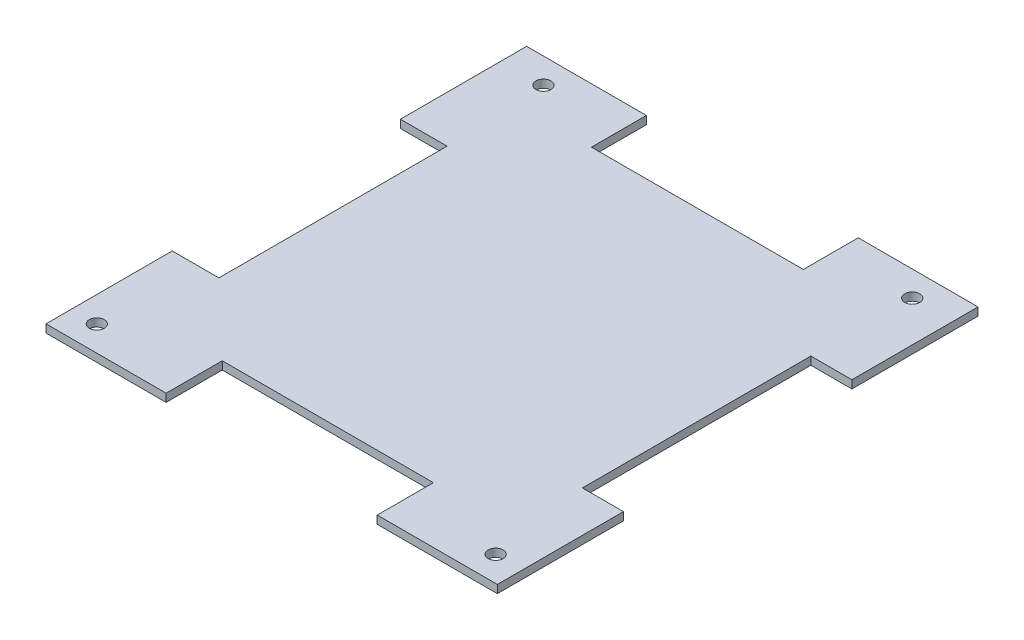
ISO-10303-21;
HEADER;
FILE_DESCRIPTION(('STEP AP214'),'2;1');
FILE_NAME('part.step','',(''),(''),'','','');
FILE_SCHEMA(('AUTOMOTIVE_DESIGN { 1 0 10303 214 1 1 1 1 }'));
ENDSEC;
DATA;
#1=APPLICATION_CONTEXT('core data for automotive mechanical design processes');
#2=APPLICATION_PROTOCOL_DEFINITION('international standard','automotive_design',2000,#1);
#3=PRODUCT_CONTEXT('',#1,'mechanical');
#4=PRODUCT('Part','Part','',(#3));
#5=PRODUCT_RELATED_PRODUCT_CATEGORY('part','',(#4));
#6=PRODUCT_DEFINITION_FORMATION('','',#4);
#7=PRODUCT_DEFINITION_CONTEXT('part definition',#1,'design');
#8=PRODUCT_DEFINITION('design','',#6,#7);
#9=PRODUCT_DEFINITION_SHAPE('','',#8);
#10=(LENGTH_UNIT() NAMED_UNIT(*) SI_UNIT(.MILLI.,.METRE.));
#11=(NAMED_UNIT(*) PLANE_ANGLE_UNIT() SI_UNIT($,.RADIAN.));
#12=(NAMED_UNIT(*) SI_UNIT($,.STERADIAN.) SOLID_ANGLE_UNIT());
#13=UNCERTAINTY_MEASURE_WITH_UNIT(LENGTH_MEASURE(1.E-05),#10,'distance_accuracy_value','');
#14=(GEOMETRIC_REPRESENTATION_CONTEXT(3) GLOBAL_UNCERTAINTY_ASSIGNED_CONTEXT((#13)) GLOBAL_UNIT_ASSIGNED_CONTEXT((#10,
#11,#12)) REPRESENTATION_CONTEXT('',''));
#15=CARTESIAN_POINT('',(0.,0.,0.));
#16=DIRECTION('',(0.,0.,1.));
#17=DIRECTION('',(1.,0.,0.));
#18=AXIS2_PLACEMENT_3D('',#15,#16,#17);
#19=CARTESIAN_POINT('',(0.,0.,2.54));
#20=DIRECTION('',(0.,0.,-1.));
#21=DIRECTION('',(-1.,0.,0.));
#22=AXIS2_PLACEMENT_3D('',#19,#20,#21);
#23=PLANE('',#22);
#24=DIRECTION('',(1.,0.,0.));
#25=VECTOR('',#24,1.);
#26=CARTESIAN_POINT('',(87.45,0.,2.54));
#27=LINE('',#26,#25);
#28=CARTESIAN_POINT('',(-2.59,0.,2.54));
#29=VERTEX_POINT('',#28);
#30=CARTESIAN_POINT('',(21.3706488480498,0.,2.54));
#31=VERTEX_POINT('',#30);
#32=EDGE_CURVE('E271',#29,#31,#27,.T.);
#33=ORIENTED_EDGE('',*,*,#32,.T.);
#34=DIRECTION('',(0.,1.,0.));
#35=VECTOR('',#34,1.);
#36=CARTESIAN_POINT('',(21.3706488480498,0.,2.54));
#37=LINE('',#36,#35);
#38=CARTESIAN_POINT('',(21.3706488480498,1.6,2.54));
#39=VERTEX_POINT('',#38);
#40=EDGE_CURVE('E11',#31,#39,#37,.T.);
#41=ORIENTED_EDGE('',*,*,#40,.T.);
#42=DIRECTION('',(-1.,0.,0.));
#43=VECTOR('',#42,1.);
#44=CARTESIAN_POINT('',(87.45,1.6,2.54));
#45=LINE('',#44,#43);
#46=CARTESIAN_POINT('',(-2.59,1.6,2.54));
#47=VERTEX_POINT('',#46);
#48=EDGE_CURVE('E264',#39,#47,#45,.T.);
#49=ORIENTED_EDGE('',*,*,#48,.T.);
#50=DIRECTION('',(0.,-1.,0.));
#51=VECTOR('',#50,1.);
#52=CARTESIAN_POINT('',(-2.59,1.6,2.54));
#53=LINE('',#52,#51);
#54=EDGE_CURVE('E268',#47,#29,#53,.T.);
#55=ORIENTED_EDGE('',*,*,#54,.T.);
#56=EDGE_LOOP('',(#33,#41,#49,#55));
#57=FACE_BOUND('',#56,.T.);
#58=ADVANCED_FACE('F34',(#57),#23,.F.);
#59=CARTESIAN_POINT('',(-2.59,0.,0.));
#60=DIRECTION('',(1.,0.,0.));
#61=DIRECTION('',(0.,0.,-1.));
#62=AXIS2_PLACEMENT_3D('',#59,#60,#61);
#63=PLANE('',#62);
#64=DIRECTION('',(0.,0.,1.));
#65=VECTOR('',#64,1.);
#66=CARTESIAN_POINT('',(-2.59,0.,-90.8));
#67=LINE('',#66,#65);
#68=CARTESIAN_POINT('',(-2.59,0.,-93.34));
#69=VERTEX_POINT('',#68);
#70=CARTESIAN_POINT('',(-2.59,0.,-68.1600542012034));
#71=VERTEX_POINT('',#70);
#72=EDGE_CURVE('E289',#69,#71,#67,.T.);
#73=ORIENTED_EDGE('',*,*,#72,.T.);
#74=DIRECTION('',(0.,1.,0.));
#75=VECTOR('',#74,1.);
#76=CARTESIAN_POINT('',(-2.59,0.,-68.1600542012034));
#77=LINE('',#76,#75);
#78=CARTESIAN_POINT('',(-2.59,1.6,-68.1600542012034));
#79=VERTEX_POINT('',#78);
#80=EDGE_CURVE('E340',#71,#79,#77,.T.);
#81=ORIENTED_EDGE('',*,*,#80,.T.);
#82=DIRECTION('',(0.,0.,-1.));
#83=VECTOR('',#82,1.);
#84=CARTESIAN_POINT('',(-2.59,1.6,-90.8));
#85=LINE('',#84,#83);
#86=CARTESIAN_POINT('',(-2.59,1.6,-93.34));
#87=VERTEX_POINT('',#86);
#88=EDGE_CURVE('E292',#79,#87,#85,.T.);
#89=ORIENTED_EDGE('',*,*,#88,.T.);
#90=DIRECTION('',(0.,1.,0.));
#91=VECTOR('',#90,1.);
#92=CARTESIAN_POINT('',(-2.59,0.,-93.34));
#93=LINE('',#92,#91);
#94=EDGE_CURVE('E274',#69,#87,#93,.T.);
#95=ORIENTED_EDGE('',*,*,#94,.F.);
#96=EDGE_LOOP('',(#73,#81,#89,#95));
#97=FACE_BOUND('',#96,.T.);
#98=ADVANCED_FACE('F373',(#97),#63,.F.);
#99=CARTESIAN_POINT('',(0.,0.,-93.34));
#100=DIRECTION('',(0.,0.,-1.));
#101=DIRECTION('',(-1.,0.,0.));
#102=AXIS2_PLACEMENT_3D('',#99,#100,#101);
#103=PLANE('',#102);
#104=DIRECTION('',(0.,1.,0.));
#105=VECTOR('',#104,1.);
#106=CARTESIAN_POINT('',(21.2967633827462,0.,-93.34));
#107=LINE('',#106,#105);
#108=CARTESIAN_POINT('',(21.2967633827462,0.,-93.34));
#109=VERTEX_POINT('',#108);
#110=CARTESIAN_POINT('',(21.2967633827462,1.6,-93.34));
#111=VERTEX_POINT('',#110);
#112=EDGE_CURVE('E336',#109,#111,#107,.T.);
#113=ORIENTED_EDGE('',*,*,#112,.F.);
#114=DIRECTION('',(-1.,0.,0.));
#115=VECTOR('',#114,1.);
#116=CARTESIAN_POINT('',(-2.59,0.,-93.34));
#117=LINE('',#116,#115);
#118=EDGE_CURVE('E284',#109,#69,#117,.T.);
#119=ORIENTED_EDGE('',*,*,#118,.T.);
#120=ORIENTED_EDGE('',*,*,#94,.T.);
#121=DIRECTION('',(1.,0.,0.));
#122=VECTOR('',#121,1.);
#123=CARTESIAN_POINT('',(-2.59,1.6,-93.34));
#124=LINE('',#123,#122);
#125=EDGE_CURVE('E278',#87,#111,#124,.T.);
#126=ORIENTED_EDGE('',*,*,#125,.T.);
#127=EDGE_LOOP('',(#113,#119,#120,#126));
#128=FACE_BOUND('',#127,.T.);
#129=ADVANCED_FACE('F377',(#128),#103,.T.);
#130=CARTESIAN_POINT('',(87.45,0.,0.));
#131=DIRECTION('',(-1.,0.,0.));
#132=DIRECTION('',(0.,0.,1.));
#133=AXIS2_PLACEMENT_3D('',#130,#131,#132);
#134=PLANE('',#133);
#135=DIRECTION('',(0.,0.,1.));
#136=VECTOR('',#135,1.);
#137=CARTESIAN_POINT('',(87.45,1.6,-90.8));
#138=LINE('',#137,#136);
#139=CARTESIAN_POINT('',(87.45,1.6,-93.34));
#140=VERTEX_POINT('',#139);
#141=CARTESIAN_POINT('',(87.45,1.6,-68.1857586213216));
#142=VERTEX_POINT('',#141);
#143=EDGE_CURVE('E297',#140,#142,#138,.T.);
#144=ORIENTED_EDGE('',*,*,#143,.T.);
#145=DIRECTION('',(0.,-1.,0.));
#146=VECTOR('',#145,1.);
#147=CARTESIAN_POINT('',(87.45,0.,-68.1857586213216));
#148=LINE('',#147,#146);
#149=CARTESIAN_POINT('',(87.45,0.,-68.1857586213216));
#150=VERTEX_POINT('',#149);
#151=EDGE_CURVE('E331',#142,#150,#148,.T.);
#152=ORIENTED_EDGE('',*,*,#151,.T.);
#153=DIRECTION('',(0.,0.,-1.));
#154=VECTOR('',#153,1.);
#155=CARTESIAN_POINT('',(87.45,0.,-90.8));
#156=LINE('',#155,#154);
#157=CARTESIAN_POINT('',(87.45,0.,-93.34));
#158=VERTEX_POINT('',#157);
#159=EDGE_CURVE('E300',#150,#158,#156,.T.);
#160=ORIENTED_EDGE('',*,*,#159,.T.);
#161=DIRECTION('',(0.,-1.,0.));
#162=VECTOR('',#161,1.);
#163=CARTESIAN_POINT('',(87.45,0.,-93.34));
#164=LINE('',#163,#162);
#165=EDGE_CURVE('E281',#140,#158,#164,.T.);
#166=ORIENTED_EDGE('',*,*,#165,.F.);
#167=EDGE_LOOP('',(#144,#152,#160,#166));
#168=FACE_BOUND('',#167,.T.);
#169=ADVANCED_FACE('F398',(#168),#134,.F.);
#170=CARTESIAN_POINT('',(0.,1.6,0.));
#171=DIRECTION('',(0.,-1.,0.));
#172=DIRECTION('',(0.,0.,-1.));
#173=AXIS2_PLACEMENT_3D('',#170,#171,#172);
#174=PLANE('',#173);
#175=CARTESIAN_POINT('',(79.37,1.6,-88.3));
#176=DIRECTION('',(0.,1.,0.));
#177=DIRECTION('',(0.,0.,1.));
#178=AXIS2_PLACEMENT_3D('',#175,#176,#177);
#179=CIRCLE('',#178,1.5);
#180=CARTESIAN_POINT('',(79.37,1.6,-86.8));
#181=VERTEX_POINT('',#180);
#182=EDGE_CURVE('E304',#181,#181,#179,.T.);
#183=ORIENTED_EDGE('',*,*,#182,.F.);
#184=EDGE_LOOP('',(#183));
#185=FACE_BOUND('',#184,.T.);
#186=CARTESIAN_POINT('',(5.8,1.6,-88.3));
#187=DIRECTION('',(0.,1.,0.));
#188=DIRECTION('',(0.,0.,1.));
#189=AXIS2_PLACEMENT_3D('',#186,#187,#188);
#190=CIRCLE('',#189,1.5);
#191=CARTESIAN_POINT('',(5.8,1.6,-86.8));
#192=VERTEX_POINT('',#191);
#193=EDGE_CURVE('E308',#192,#192,#190,.T.);
#194=ORIENTED_EDGE('',*,*,#193,.F.);
#195=EDGE_LOOP('',(#194));
#196=FACE_BOUND('',#195,.T.);
#197=CARTESIAN_POINT('',(82.07,1.6,-2.5));
#198=DIRECTION('',(0.,1.,0.));
#199=DIRECTION('',(0.,0.,1.));
#200=AXIS2_PLACEMENT_3D('',#197,#198,#199);
#201=CIRCLE('',#200,1.5);
#202=CARTESIAN_POINT('',(82.07,1.6,-1.));
#203=VERTEX_POINT('',#202);
#204=EDGE_CURVE('E314',#203,#203,#201,.T.);
#205=ORIENTED_EDGE('',*,*,#204,.F.);
#206=EDGE_LOOP('',(#205));
#207=FACE_BOUND('',#206,.T.);
#208=CARTESIAN_POINT('',(2.5,1.6,-2.5));
#209=DIRECTION('',(0.,1.,0.));
#210=DIRECTION('',(0.,0.,1.));
#211=AXIS2_PLACEMENT_3D('',#208,#209,#210);
#212=CIRCLE('',#211,1.5);
#213=CARTESIAN_POINT('',(2.5,1.6,-1.));
#214=VERTEX_POINT('',#213);
#215=EDGE_CURVE('E320',#214,#214,#212,.T.);
#216=ORIENTED_EDGE('',*,*,#215,.F.);
#217=EDGE_LOOP('',(#216));
#218=FACE_BOUND('',#217,.T.);
#219=ORIENTED_EDGE('',*,*,#48,.F.);
#220=DIRECTION('',(0.,0.,1.));
#221=VECTOR('',#220,1.);
#222=CARTESIAN_POINT('',(21.3706488480498,1.6,-8.66006941402019));
#223=LINE('',#222,#221);
#224=CARTESIAN_POINT('',(21.3706488480498,1.6,-8.66006941402019));
#225=VERTEX_POINT('',#224);
#226=EDGE_CURVE('E195',#225,#39,#223,.T.);
#227=ORIENTED_EDGE('',*,*,#226,.F.);
#228=DIRECTION('',(-1.,0.,0.));
#229=VECTOR('',#228,1.);
#230=CARTESIAN_POINT('',(63.4893511519502,1.6,-8.6600694140202));
#231=LINE('',#230,#229);
#232=CARTESIAN_POINT('',(63.4893511519502,1.6,-8.6600694140202));
#233=VERTEX_POINT('',#232);
#234=EDGE_CURVE('E192',#233,#225,#231,.T.);
#235=ORIENTED_EDGE('',*,*,#234,.F.);
#236=DIRECTION('',(0.,0.,-1.));
#237=VECTOR('',#236,1.);
#238=CARTESIAN_POINT('',(63.4893511519502,1.6,-8.6600694140202));
#239=LINE('',#238,#237);
#240=CARTESIAN_POINT('',(63.4893511519502,1.6,2.54));
#241=VERTEX_POINT('',#240);
#242=EDGE_CURVE('E173',#241,#233,#239,.T.);
#243=ORIENTED_EDGE('',*,*,#242,.F.);
#244=CARTESIAN_POINT('',(87.45,1.6,2.54));
#245=VERTEX_POINT('',#244);
#246=EDGE_CURVE('E265',#245,#241,#45,.T.);
#247=ORIENTED_EDGE('',*,*,#246,.F.);
#248=CARTESIAN_POINT('',(87.45,1.6,-22.6142413786784));
#249=VERTEX_POINT('',#248);
#250=EDGE_CURVE('E296',#249,#245,#138,.T.);
#251=ORIENTED_EDGE('',*,*,#250,.F.);
#252=DIRECTION('',(1.,0.,0.));
#253=VECTOR('',#252,1.);
#254=CARTESIAN_POINT('',(95.6363214880288,1.6,-22.6142413786784));
#255=LINE('',#254,#253);
#256=CARTESIAN_POINT('',(79.2636785119712,1.6,-22.6142413786784));
#257=VERTEX_POINT('',#256);
#258=EDGE_CURVE('E254',#257,#249,#255,.T.);
#259=ORIENTED_EDGE('',*,*,#258,.F.);
#260=DIRECTION('',(0.,0.,1.));
#261=VECTOR('',#260,1.);
#262=CARTESIAN_POINT('',(79.2636785119711,1.6,-68.1857586213216));
#263=LINE('',#262,#261);
#264=CARTESIAN_POINT('',(79.2636785119711,1.6,-68.1857586213216));
#265=VERTEX_POINT('',#264);
#266=EDGE_CURVE('E238',#265,#257,#263,.T.);
#267=ORIENTED_EDGE('',*,*,#266,.F.);
#268=DIRECTION('',(-1.,0.,0.));
#269=VECTOR('',#268,1.);
#270=CARTESIAN_POINT('',(95.6363214880288,1.6,-68.1857586213216));
#271=LINE('',#270,#269);
#272=EDGE_CURVE('E245',#142,#265,#271,.T.);
#273=ORIENTED_EDGE('',*,*,#272,.F.);
#274=ORIENTED_EDGE('',*,*,#143,.F.);
#275=CARTESIAN_POINT('',(63.5632366172538,1.6,-93.34));
#276=VERTEX_POINT('',#275);
#277=EDGE_CURVE('E277',#276,#140,#124,.T.);
#278=ORIENTED_EDGE('',*,*,#277,.F.);
#279=DIRECTION('',(0.,0.,-1.));
#280=VECTOR('',#279,1.);
#281=CARTESIAN_POINT('',(63.5632366172538,1.6,-104.290532807686));
#282=LINE('',#281,#280);
#283=CARTESIAN_POINT('',(63.5632366172538,1.6,-82.3894671923142));
#284=VERTEX_POINT('',#283);
#285=EDGE_CURVE('E224',#284,#276,#282,.T.);
#286=ORIENTED_EDGE('',*,*,#285,.F.);
#287=DIRECTION('',(1.,0.,0.));
#288=VECTOR('',#287,1.);
#289=CARTESIAN_POINT('',(63.5632366172538,1.6,-82.3894671923142));
#290=LINE('',#289,#288);
#291=CARTESIAN_POINT('',(21.2967633827462,1.6,-82.3894671923142));
#292=VERTEX_POINT('',#291);
#293=EDGE_CURVE('E232',#292,#284,#290,.T.);
#294=ORIENTED_EDGE('',*,*,#293,.F.);
#295=DIRECTION('',(0.,0.,1.));
#296=VECTOR('',#295,1.);
#297=CARTESIAN_POINT('',(21.2967633827462,1.6,-104.290532807686));
#298=LINE('',#297,#296);
#299=EDGE_CURVE('E217',#111,#292,#298,.T.);
#300=ORIENTED_EDGE('',*,*,#299,.F.);
#301=ORIENTED_EDGE('',*,*,#125,.F.);
#302=ORIENTED_EDGE('',*,*,#88,.F.);
#303=DIRECTION('',(-1.,0.,0.));
#304=VECTOR('',#303,1.);
#305=CARTESIAN_POINT('',(6.71850682793007,1.6,-68.1600542012034));
#306=LINE('',#305,#304);
#307=CARTESIAN_POINT('',(6.71850682793007,1.6,-68.1600542012034));
#308=VERTEX_POINT('',#307);
#309=EDGE_CURVE('E203',#308,#79,#306,.T.);
#310=ORIENTED_EDGE('',*,*,#309,.F.);
#311=DIRECTION('',(0.,0.,-1.));
#312=VECTOR('',#311,1.);
#313=CARTESIAN_POINT('',(6.71850682793007,1.6,-68.1600542012034));
#314=LINE('',#313,#312);
#315=CARTESIAN_POINT('',(6.71850682793007,1.6,-22.6399457987966));
#316=VERTEX_POINT('',#315);
#317=EDGE_CURVE('E211',#316,#308,#314,.T.);
#318=ORIENTED_EDGE('',*,*,#317,.F.);
#319=DIRECTION('',(1.,0.,0.));
#320=VECTOR('',#319,1.);
#321=CARTESIAN_POINT('',(6.71850682793007,1.6,-22.6399457987966));
#322=LINE('',#321,#320);
#323=CARTESIAN_POINT('',(-2.59,1.6,-22.6399457987966));
#324=VERTEX_POINT('',#323);
#325=EDGE_CURVE('E199',#324,#316,#322,.T.);
#326=ORIENTED_EDGE('',*,*,#325,.F.);
#327=EDGE_CURVE('E293',#47,#324,#85,.T.);
#328=ORIENTED_EDGE('',*,*,#327,.F.);
#329=EDGE_LOOP('',(#219,#227,#235,#243,#247,#251,#259,#267,#273,#274,#278,#286,#294,#300,#301,
#302,#310,#318,#326,#328));
#330=FACE_BOUND('',#329,.T.);
#331=ADVANCED_FACE('F347',(#185,#196,#207,#218,#330),#174,.F.);
#332=CARTESIAN_POINT('',(0.,0.,0.));
#333=DIRECTION('',(0.,-1.,0.));
#334=DIRECTION('',(0.,0.,-1.));
#335=AXIS2_PLACEMENT_3D('',#332,#333,#334);
#336=PLANE('',#335);
#337=DIRECTION('',(0.,0.,1.));
#338=VECTOR('',#337,1.);
#339=CARTESIAN_POINT('',(21.3706488480498,0.,-8.66006941402019));
#340=LINE('',#339,#338);
#341=CARTESIAN_POINT('',(21.3706488480498,0.,-8.66006941402019));
#342=VERTEX_POINT('',#341);
#343=EDGE_CURVE('E190',#342,#31,#340,.T.);
#344=ORIENTED_EDGE('',*,*,#343,.T.);
#345=ORIENTED_EDGE('',*,*,#32,.F.);
#346=CARTESIAN_POINT('',(-2.59,0.,-22.6399457987966));
#347=VERTEX_POINT('',#346);
#348=EDGE_CURVE('E288',#347,#29,#67,.T.);
#349=ORIENTED_EDGE('',*,*,#348,.F.);
#350=DIRECTION('',(1.,0.,0.));
#351=VECTOR('',#350,1.);
#352=CARTESIAN_POINT('',(6.71850682793007,0.,-22.6399457987966));
#353=LINE('',#352,#351);
#354=CARTESIAN_POINT('',(6.71850682793007,0.,-22.6399457987966));
#355=VERTEX_POINT('',#354);
#356=EDGE_CURVE('E57',#347,#355,#353,.T.);
#357=ORIENTED_EDGE('',*,*,#356,.T.);
#358=DIRECTION('',(0.,0.,-1.));
#359=VECTOR('',#358,1.);
#360=CARTESIAN_POINT('',(6.71850682793007,0.,-68.1600542012034));
#361=LINE('',#360,#359);
#362=CARTESIAN_POINT('',(6.71850682793007,0.,-68.1600542012034));
#363=VERTEX_POINT('',#362);
#364=EDGE_CURVE('E202',#355,#363,#361,.T.);
#365=ORIENTED_EDGE('',*,*,#364,.T.);
#366=DIRECTION('',(-1.,0.,0.));
#367=VECTOR('',#366,1.);
#368=CARTESIAN_POINT('',(6.71850682793007,0.,-68.1600542012034));
#369=LINE('',#368,#367);
#370=EDGE_CURVE('E206',#363,#71,#369,.T.);
#371=ORIENTED_EDGE('',*,*,#370,.T.);
#372=ORIENTED_EDGE('',*,*,#72,.F.);
#373=ORIENTED_EDGE('',*,*,#118,.F.);
#374=DIRECTION('',(0.,0.,1.));
#375=VECTOR('',#374,1.);
#376=CARTESIAN_POINT('',(21.2967633827462,0.,-104.290532807686));
#377=LINE('',#376,#375);
#378=CARTESIAN_POINT('',(21.2967633827462,0.,-82.3894671923142));
#379=VERTEX_POINT('',#378);
#380=EDGE_CURVE('E220',#109,#379,#377,.T.);
#381=ORIENTED_EDGE('',*,*,#380,.T.);
#382=DIRECTION('',(1.,0.,0.));
#383=VECTOR('',#382,1.);
#384=CARTESIAN_POINT('',(63.5632366172538,0.,-82.3894671923142));
#385=LINE('',#384,#383);
#386=CARTESIAN_POINT('',(63.5632366172538,0.,-82.3894671923142));
#387=VERTEX_POINT('',#386);
#388=EDGE_CURVE('E223',#379,#387,#385,.T.);
#389=ORIENTED_EDGE('',*,*,#388,.T.);
#390=DIRECTION('',(0.,0.,-1.));
#391=VECTOR('',#390,1.);
#392=CARTESIAN_POINT('',(63.5632366172538,0.,-104.290532807686));
#393=LINE('',#392,#391);
#394=CARTESIAN_POINT('',(63.5632366172538,0.,-93.34));
#395=VERTEX_POINT('',#394);
#396=EDGE_CURVE('E227',#387,#395,#393,.T.);
#397=ORIENTED_EDGE('',*,*,#396,.T.);
#398=EDGE_CURVE('E285',#158,#395,#117,.T.);
#399=ORIENTED_EDGE('',*,*,#398,.F.);
#400=ORIENTED_EDGE('',*,*,#159,.F.);
#401=DIRECTION('',(-1.,0.,0.));
#402=VECTOR('',#401,1.);
#403=CARTESIAN_POINT('',(95.6363214880288,0.,-68.1857586213216));
#404=LINE('',#403,#402);
#405=CARTESIAN_POINT('',(79.2636785119711,0.,-68.1857586213216));
#406=VERTEX_POINT('',#405);
#407=EDGE_CURVE('E248',#150,#406,#404,.T.);
#408=ORIENTED_EDGE('',*,*,#407,.T.);
#409=DIRECTION('',(0.,0.,1.));
#410=VECTOR('',#409,1.);
#411=CARTESIAN_POINT('',(79.2636785119711,0.,-68.1857586213216));
#412=LINE('',#411,#410);
#413=CARTESIAN_POINT('',(79.2636785119712,0.,-22.6142413786784));
#414=VERTEX_POINT('',#413);
#415=EDGE_CURVE('E241',#406,#414,#412,.T.);
#416=ORIENTED_EDGE('',*,*,#415,.T.);
#417=DIRECTION('',(1.,0.,0.));
#418=VECTOR('',#417,1.);
#419=CARTESIAN_POINT('',(95.6363214880288,0.,-22.6142413786784));
#420=LINE('',#419,#418);
#421=CARTESIAN_POINT('',(87.45,0.,-22.6142413786784));
#422=VERTEX_POINT('',#421);
#423=EDGE_CURVE('E244',#414,#422,#420,.T.);
#424=ORIENTED_EDGE('',*,*,#423,.T.);
#425=CARTESIAN_POINT('',(87.45,0.,2.54));
#426=VERTEX_POINT('',#425);
#427=EDGE_CURVE('E301',#426,#422,#156,.T.);
#428=ORIENTED_EDGE('',*,*,#427,.F.);
#429=CARTESIAN_POINT('',(63.4893511519502,0.,2.54));
#430=VERTEX_POINT('',#429);
#431=EDGE_CURVE('E189',#430,#426,#27,.T.);
#432=ORIENTED_EDGE('',*,*,#431,.F.);
#433=DIRECTION('',(0.,0.,-1.));
#434=VECTOR('',#433,1.);
#435=CARTESIAN_POINT('',(63.4893511519502,0.,-8.6600694140202));
#436=LINE('',#435,#434);
#437=CARTESIAN_POINT('',(63.4893511519502,0.,-8.6600694140202));
#438=VERTEX_POINT('',#437);
#439=EDGE_CURVE('E49',#430,#438,#436,.T.);
#440=ORIENTED_EDGE('',*,*,#439,.T.);
#441=DIRECTION('',(-1.,0.,0.));
#442=VECTOR('',#441,1.);
#443=CARTESIAN_POINT('',(63.4893511519502,0.,-8.6600694140202));
#444=LINE('',#443,#442);
#445=EDGE_CURVE('E178',#438,#342,#444,.T.);
#446=ORIENTED_EDGE('',*,*,#445,.T.);
#447=EDGE_LOOP('',(#344,#345,#349,#357,#365,#371,#372,#373,#381,#389,#397,#399,#400,#408,#416,
#424,#428,#432,#440,#446));
#448=FACE_BOUND('',#447,.T.);
#449=CARTESIAN_POINT('',(79.37,0.,-88.3));
#450=DIRECTION('',(0.,1.,0.));
#451=DIRECTION('',(0.,0.,1.));
#452=AXIS2_PLACEMENT_3D('',#449,#450,#451);
#453=CIRCLE('',#452,1.5);
#454=CARTESIAN_POINT('',(79.37,0.,-86.8));
#455=VERTEX_POINT('',#454);
#456=EDGE_CURVE('E305',#455,#455,#453,.T.);
#457=ORIENTED_EDGE('',*,*,#456,.T.);
#458=EDGE_LOOP('',(#457));
#459=FACE_BOUND('',#458,.T.);
#460=CARTESIAN_POINT('',(5.8,0.,-88.3));
#461=DIRECTION('',(0.,1.,0.));
#462=DIRECTION('',(0.,0.,1.));
#463=AXIS2_PLACEMENT_3D('',#460,#461,#462);
#464=CIRCLE('',#463,1.5);
#465=CARTESIAN_POINT('',(5.8,0.,-86.8));
#466=VERTEX_POINT('',#465);
#467=EDGE_CURVE('E311',#466,#466,#464,.T.);
#468=ORIENTED_EDGE('',*,*,#467,.T.);
#469=EDGE_LOOP('',(#468));
#470=FACE_BOUND('',#469,.T.);
#471=CARTESIAN_POINT('',(82.07,0.,-2.5));
#472=DIRECTION('',(0.,1.,0.));
#473=DIRECTION('',(0.,0.,1.));
#474=AXIS2_PLACEMENT_3D('',#471,#472,#473);
#475=CIRCLE('',#474,1.5);
#476=CARTESIAN_POINT('',(82.07,0.,-1.));
#477=VERTEX_POINT('',#476);
#478=EDGE_CURVE('E317',#477,#477,#475,.T.);
#479=ORIENTED_EDGE('',*,*,#478,.T.);
#480=EDGE_LOOP('',(#479));
#481=FACE_BOUND('',#480,.T.);
#482=CARTESIAN_POINT('',(2.5,0.,-2.5));
#483=DIRECTION('',(0.,1.,0.));
#484=DIRECTION('',(0.,0.,1.));
#485=AXIS2_PLACEMENT_3D('',#482,#483,#484);
#486=CIRCLE('',#485,1.5);
#487=CARTESIAN_POINT('',(2.5,0.,-1.));
#488=VERTEX_POINT('',#487);
#489=EDGE_CURVE('E323',#488,#488,#486,.T.);
#490=ORIENTED_EDGE('',*,*,#489,.T.);
#491=EDGE_LOOP('',(#490));
#492=FACE_BOUND('',#491,.T.);
#493=ADVANCED_FACE('F36',(#448,#459,#470,#481,#492),#336,.T.);
#494=CARTESIAN_POINT('',(2.5,0.,-2.5));
#495=DIRECTION('',(0.,1.,0.));
#496=DIRECTION('',(0.,0.,1.));
#497=AXIS2_PLACEMENT_3D('',#494,#495,#496);
#498=CYLINDRICAL_SURFACE('',#497,1.5);
#499=ORIENTED_EDGE('',*,*,#489,.F.);
#500=EDGE_LOOP('',(#499));
#501=FACE_BOUND('',#500,.T.);
#502=ORIENTED_EDGE('',*,*,#215,.T.);
#503=EDGE_LOOP('',(#502));
#504=FACE_BOUND('',#503,.T.);
#505=ADVANCED_FACE('F461',(#501,#504),#498,.F.);
#506=CARTESIAN_POINT('',(82.07,0.,-2.5));
#507=DIRECTION('',(0.,1.,0.));
#508=DIRECTION('',(0.,0.,1.));
#509=AXIS2_PLACEMENT_3D('',#506,#507,#508);
#510=CYLINDRICAL_SURFACE('',#509,1.5);
#511=ORIENTED_EDGE('',*,*,#478,.F.);
#512=EDGE_LOOP('',(#511));
#513=FACE_BOUND('',#512,.T.);
#514=ORIENTED_EDGE('',*,*,#204,.T.);
#515=EDGE_LOOP('',(#514));
#516=FACE_BOUND('',#515,.T.);
#517=ADVANCED_FACE('F467',(#513,#516),#510,.F.);
#518=CARTESIAN_POINT('',(5.8,0.,-88.3));
#519=DIRECTION('',(0.,1.,0.));
#520=DIRECTION('',(0.,0.,1.));
#521=AXIS2_PLACEMENT_3D('',#518,#519,#520);
#522=CYLINDRICAL_SURFACE('',#521,1.5);
#523=ORIENTED_EDGE('',*,*,#467,.F.);
#524=EDGE_LOOP('',(#523));
#525=FACE_BOUND('',#524,.T.);
#526=ORIENTED_EDGE('',*,*,#193,.T.);
#527=EDGE_LOOP('',(#526));
#528=FACE_BOUND('',#527,.T.);
#529=ADVANCED_FACE('F421',(#525,#528),#522,.F.);
#530=CARTESIAN_POINT('',(79.37,0.,-88.3));
#531=DIRECTION('',(0.,1.,0.));
#532=DIRECTION('',(0.,0.,1.));
#533=AXIS2_PLACEMENT_3D('',#530,#531,#532);
#534=CYLINDRICAL_SURFACE('',#533,1.5);
#535=ORIENTED_EDGE('',*,*,#456,.F.);
#536=EDGE_LOOP('',(#535));
#537=FACE_BOUND('',#536,.T.);
#538=ORIENTED_EDGE('',*,*,#182,.T.);
#539=EDGE_LOOP('',(#538));
#540=FACE_BOUND('',#539,.T.);
#541=ADVANCED_FACE('F414',(#537,#540),#534,.F.);
#542=ORIENTED_EDGE('',*,*,#427,.T.);
#543=DIRECTION('',(0.,1.,0.));
#544=VECTOR('',#543,1.);
#545=CARTESIAN_POINT('',(87.45,0.,-22.6142413786784));
#546=LINE('',#545,#544);
#547=EDGE_CURVE('E326',#422,#249,#546,.T.);
#548=ORIENTED_EDGE('',*,*,#547,.T.);
#549=ORIENTED_EDGE('',*,*,#250,.T.);
#550=DIRECTION('',(0.,1.,0.));
#551=VECTOR('',#550,1.);
#552=CARTESIAN_POINT('',(87.45,1.6,2.54));
#553=LINE('',#552,#551);
#554=EDGE_CURVE('E260',#426,#245,#553,.T.);
#555=ORIENTED_EDGE('',*,*,#554,.F.);
#556=EDGE_LOOP('',(#542,#548,#549,#555));
#557=FACE_BOUND('',#556,.T.);
#558=ADVANCED_FACE('F412',(#557),#134,.F.);
#559=ORIENTED_EDGE('',*,*,#327,.T.);
#560=DIRECTION('',(0.,-1.,0.));
#561=VECTOR('',#560,1.);
#562=CARTESIAN_POINT('',(-2.59,0.,-22.6399457987966));
#563=LINE('',#562,#561);
#564=EDGE_CURVE('E338',#324,#347,#563,.T.);
#565=ORIENTED_EDGE('',*,*,#564,.T.);
#566=ORIENTED_EDGE('',*,*,#348,.T.);
#567=ORIENTED_EDGE('',*,*,#54,.F.);
#568=EDGE_LOOP('',(#559,#565,#566,#567));
#569=FACE_BOUND('',#568,.T.);
#570=ADVANCED_FACE('F358',(#569),#63,.F.);
#571=DIRECTION('',(0.,-1.,0.));
#572=VECTOR('',#571,1.);
#573=CARTESIAN_POINT('',(63.5632366172538,0.,-93.34));
#574=LINE('',#573,#572);
#575=EDGE_CURVE('E334',#276,#395,#574,.T.);
#576=ORIENTED_EDGE('',*,*,#575,.F.);
#577=ORIENTED_EDGE('',*,*,#277,.T.);
#578=ORIENTED_EDGE('',*,*,#165,.T.);
#579=ORIENTED_EDGE('',*,*,#398,.T.);
#580=EDGE_LOOP('',(#576,#577,#578,#579));
#581=FACE_BOUND('',#580,.T.);
#582=ADVANCED_FACE('F393',(#581),#103,.T.);
#583=ORIENTED_EDGE('',*,*,#246,.T.);
#584=DIRECTION('',(0.,-1.,0.));
#585=VECTOR('',#584,1.);
#586=CARTESIAN_POINT('',(63.4893511519502,0.,2.54));
#587=LINE('',#586,#585);
#588=EDGE_CURVE('E42',#241,#430,#587,.T.);
#589=ORIENTED_EDGE('',*,*,#588,.T.);
#590=ORIENTED_EDGE('',*,*,#431,.T.);
#591=ORIENTED_EDGE('',*,*,#554,.T.);
#592=EDGE_LOOP('',(#583,#589,#590,#591));
#593=FACE_BOUND('',#592,.T.);
#594=ADVANCED_FACE('F343',(#593),#23,.F.);
#595=CARTESIAN_POINT('',(95.6363214880288,0.,-68.1857586213216));
#596=DIRECTION('',(0.,0.,-1.));
#597=DIRECTION('',(-1.,0.,0.));
#598=AXIS2_PLACEMENT_3D('',#595,#596,#597);
#599=PLANE('',#598);
#600=ORIENTED_EDGE('',*,*,#272,.T.);
#601=DIRECTION('',(0.,1.,0.));
#602=VECTOR('',#601,1.);
#603=CARTESIAN_POINT('',(79.2636785119711,0.,-68.1857586213216));
#604=LINE('',#603,#602);
#605=EDGE_CURVE('E257',#406,#265,#604,.T.);
#606=ORIENTED_EDGE('',*,*,#605,.F.);
#607=ORIENTED_EDGE('',*,*,#407,.F.);
#608=ORIENTED_EDGE('',*,*,#151,.F.);
#609=EDGE_LOOP('',(#600,#606,#607,#608));
#610=FACE_BOUND('',#609,.T.);
#611=ADVANCED_FACE('F401',(#610),#599,.F.);
#612=CARTESIAN_POINT('',(95.6363214880288,0.,-22.6142413786784));
#613=DIRECTION('',(0.,0.,1.));
#614=DIRECTION('',(1.,0.,0.));
#615=AXIS2_PLACEMENT_3D('',#612,#613,#614);
#616=PLANE('',#615);
#617=ORIENTED_EDGE('',*,*,#423,.F.);
#618=DIRECTION('',(0.,1.,0.));
#619=VECTOR('',#618,1.);
#620=CARTESIAN_POINT('',(79.2636785119712,0.,-22.6142413786784));
#621=LINE('',#620,#619);
#622=EDGE_CURVE('E251',#414,#257,#621,.T.);
#623=ORIENTED_EDGE('',*,*,#622,.T.);
#624=ORIENTED_EDGE('',*,*,#258,.T.);
#625=ORIENTED_EDGE('',*,*,#547,.F.);
#626=EDGE_LOOP('',(#617,#623,#624,#625));
#627=FACE_BOUND('',#626,.T.);
#628=ADVANCED_FACE('F409',(#627),#616,.F.);
#629=CARTESIAN_POINT('',(79.2636785119711,0.,-68.1857586213216));
#630=DIRECTION('',(-1.,0.,0.));
#631=DIRECTION('',(0.,0.,1.));
#632=AXIS2_PLACEMENT_3D('',#629,#630,#631);
#633=PLANE('',#632);
#634=ORIENTED_EDGE('',*,*,#266,.T.);
#635=ORIENTED_EDGE('',*,*,#622,.F.);
#636=ORIENTED_EDGE('',*,*,#415,.F.);
#637=ORIENTED_EDGE('',*,*,#605,.T.);
#638=EDGE_LOOP('',(#634,#635,#636,#637));
#639=FACE_BOUND('',#638,.T.);
#640=ADVANCED_FACE('F405',(#639),#633,.F.);
#641=CARTESIAN_POINT('',(21.2967633827462,0.,-104.290532807686));
#642=DIRECTION('',(-1.,0.,0.));
#643=DIRECTION('',(0.,0.,1.));
#644=AXIS2_PLACEMENT_3D('',#641,#642,#643);
#645=PLANE('',#644);
#646=ORIENTED_EDGE('',*,*,#112,.T.);
#647=ORIENTED_EDGE('',*,*,#299,.T.);
#648=DIRECTION('',(0.,1.,0.));
#649=VECTOR('',#648,1.);
#650=CARTESIAN_POINT('',(21.2967633827462,0.,-82.3894671923142));
#651=LINE('',#650,#649);
#652=EDGE_CURVE('E230',#379,#292,#651,.T.);
#653=ORIENTED_EDGE('',*,*,#652,.F.);
#654=ORIENTED_EDGE('',*,*,#380,.F.);
#655=EDGE_LOOP('',(#646,#647,#653,#654));
#656=FACE_BOUND('',#655,.T.);
#657=ADVANCED_FACE('F380',(#656),#645,.F.);
#658=CARTESIAN_POINT('',(63.5632366172538,0.,-104.290532807686));
#659=DIRECTION('',(1.,0.,0.));
#660=DIRECTION('',(0.,0.,-1.));
#661=AXIS2_PLACEMENT_3D('',#658,#659,#660);
#662=PLANE('',#661);
#663=ORIENTED_EDGE('',*,*,#575,.T.);
#664=ORIENTED_EDGE('',*,*,#396,.F.);
#665=DIRECTION('',(0.,1.,0.));
#666=VECTOR('',#665,1.);
#667=CARTESIAN_POINT('',(63.5632366172538,0.,-82.3894671923142));
#668=LINE('',#667,#666);
#669=EDGE_CURVE('E236',#387,#284,#668,.T.);
#670=ORIENTED_EDGE('',*,*,#669,.T.);
#671=ORIENTED_EDGE('',*,*,#285,.T.);
#672=EDGE_LOOP('',(#663,#664,#670,#671));
#673=FACE_BOUND('',#672,.T.);
#674=ADVANCED_FACE('F388',(#673),#662,.F.);
#675=CARTESIAN_POINT('',(63.5632366172538,0.,-82.3894671923142));
#676=DIRECTION('',(0.,0.,1.));
#677=DIRECTION('',(1.,0.,0.));
#678=AXIS2_PLACEMENT_3D('',#675,#676,#677);
#679=PLANE('',#678);
#680=ORIENTED_EDGE('',*,*,#293,.T.);
#681=ORIENTED_EDGE('',*,*,#669,.F.);
#682=ORIENTED_EDGE('',*,*,#388,.F.);
#683=ORIENTED_EDGE('',*,*,#652,.T.);
#684=EDGE_LOOP('',(#680,#681,#682,#683));
#685=FACE_BOUND('',#684,.T.);
#686=ADVANCED_FACE('F384',(#685),#679,.F.);
#687=CARTESIAN_POINT('',(6.71850682793007,0.,-68.1600542012034));
#688=DIRECTION('',(0.,0.,-1.));
#689=DIRECTION('',(-1.,0.,0.));
#690=AXIS2_PLACEMENT_3D('',#687,#688,#689);
#691=PLANE('',#690);
#692=ORIENTED_EDGE('',*,*,#370,.F.);
#693=DIRECTION('',(0.,1.,0.));
#694=VECTOR('',#693,1.);
#695=CARTESIAN_POINT('',(6.71850682793007,0.,-68.1600542012034));
#696=LINE('',#695,#694);
#697=EDGE_CURVE('E215',#363,#308,#696,.T.);
#698=ORIENTED_EDGE('',*,*,#697,.T.);
#699=ORIENTED_EDGE('',*,*,#309,.T.);
#700=ORIENTED_EDGE('',*,*,#80,.F.);
#701=EDGE_LOOP('',(#692,#698,#699,#700));
#702=FACE_BOUND('',#701,.T.);
#703=ADVANCED_FACE('F621',(#702),#691,.F.);
#704=CARTESIAN_POINT('',(6.71850682793007,0.,-22.6399457987966));
#705=DIRECTION('',(0.,0.,1.));
#706=DIRECTION('',(1.,0.,0.));
#707=AXIS2_PLACEMENT_3D('',#704,#705,#706);
#708=PLANE('',#707);
#709=ORIENTED_EDGE('',*,*,#325,.T.);
#710=DIRECTION('',(0.,1.,0.));
#711=VECTOR('',#710,1.);
#712=CARTESIAN_POINT('',(6.71850682793007,0.,-22.6399457987966));
#713=LINE('',#712,#711);
#714=EDGE_CURVE('E209',#355,#316,#713,.T.);
#715=ORIENTED_EDGE('',*,*,#714,.F.);
#716=ORIENTED_EDGE('',*,*,#356,.F.);
#717=ORIENTED_EDGE('',*,*,#564,.F.);
#718=EDGE_LOOP('',(#709,#715,#716,#717));
#719=FACE_BOUND('',#718,.T.);
#720=ADVANCED_FACE('F360',(#719),#708,.F.);
#721=CARTESIAN_POINT('',(6.71850682793007,0.,-68.1600542012034));
#722=DIRECTION('',(1.,0.,0.));
#723=DIRECTION('',(0.,0.,-1.));
#724=AXIS2_PLACEMENT_3D('',#721,#722,#723);
#725=PLANE('',#724);
#726=ORIENTED_EDGE('',*,*,#317,.T.);
#727=ORIENTED_EDGE('',*,*,#697,.F.);
#728=ORIENTED_EDGE('',*,*,#364,.F.);
#729=ORIENTED_EDGE('',*,*,#714,.T.);
#730=EDGE_LOOP('',(#726,#727,#728,#729));
#731=FACE_BOUND('',#730,.T.);
#732=ADVANCED_FACE('F365',(#731),#725,.F.);
#733=CARTESIAN_POINT('',(21.3706488480498,0.,-8.66006941402019));
#734=DIRECTION('',(-1.,0.,0.));
#735=DIRECTION('',(0.,0.,1.));
#736=AXIS2_PLACEMENT_3D('',#733,#734,#735);
#737=PLANE('',#736);
#738=ORIENTED_EDGE('',*,*,#343,.F.);
#739=DIRECTION('',(0.,1.,0.));
#740=VECTOR('',#739,1.);
#741=CARTESIAN_POINT('',(21.3706488480498,0.,-8.66006941402019));
#742=LINE('',#741,#740);
#743=EDGE_CURVE('E177',#342,#225,#742,.T.);
#744=ORIENTED_EDGE('',*,*,#743,.T.);
#745=ORIENTED_EDGE('',*,*,#226,.T.);
#746=ORIENTED_EDGE('',*,*,#40,.F.);
#747=EDGE_LOOP('',(#738,#744,#745,#746));
#748=FACE_BOUND('',#747,.T.);
#749=ADVANCED_FACE('F352',(#748),#737,.F.);
#750=CARTESIAN_POINT('',(63.4893511519502,0.,-8.6600694140202));
#751=DIRECTION('',(1.,0.,0.));
#752=DIRECTION('',(0.,0.,-1.));
#753=AXIS2_PLACEMENT_3D('',#750,#751,#752);
#754=PLANE('',#753);
#755=ORIENTED_EDGE('',*,*,#242,.T.);
#756=DIRECTION('',(0.,1.,0.));
#757=VECTOR('',#756,1.);
#758=CARTESIAN_POINT('',(63.4893511519502,0.,-8.6600694140202));
#759=LINE('',#758,#757);
#760=EDGE_CURVE('E169',#438,#233,#759,.T.);
#761=ORIENTED_EDGE('',*,*,#760,.F.);
#762=ORIENTED_EDGE('',*,*,#439,.F.);
#763=ORIENTED_EDGE('',*,*,#588,.F.);
#764=EDGE_LOOP('',(#755,#761,#762,#763));
#765=FACE_BOUND('',#764,.T.);
#766=ADVANCED_FACE('F171',(#765),#754,.F.);
#767=CARTESIAN_POINT('',(63.4893511519502,0.,-8.6600694140202));
#768=DIRECTION('',(0.,0.,-1.));
#769=DIRECTION('',(-1.,0.,0.));
#770=AXIS2_PLACEMENT_3D('',#767,#768,#769);
#771=PLANE('',#770);
#772=ORIENTED_EDGE('',*,*,#234,.T.);
#773=ORIENTED_EDGE('',*,*,#743,.F.);
#774=ORIENTED_EDGE('',*,*,#445,.F.);
#775=ORIENTED_EDGE('',*,*,#760,.T.);
#776=EDGE_LOOP('',(#772,#773,#774,#775));
#777=FACE_BOUND('',#776,.T.);
#778=ADVANCED_FACE('F181',(#777),#771,.F.);
#779=CLOSED_SHELL('',(#58,#98,#129,#169,#331,#493,#505,#517,#529,#541,#558,#570,#582,#594,#611,
#628,#640,#657,#674,#686,#703,#720,#732,#749,#766,#778));
#780=MANIFOLD_SOLID_BREP('B2',#779);
#781=ADVANCED_BREP_SHAPE_REPRESENTATION('',(#18,#780),#14);
#782=SHAPE_DEFINITION_REPRESENTATION(#9,#781);
ENDSEC;
END-ISO-10303-21;
